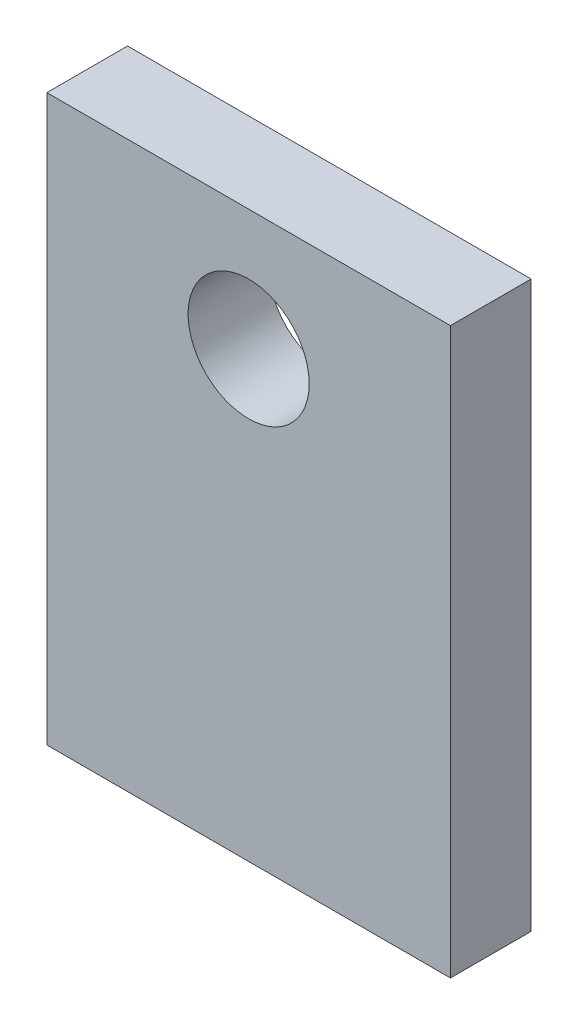
ISO-10303-21;
HEADER;
FILE_DESCRIPTION(('STEP AP214'),'2;1');
FILE_NAME('part.step','',(''),(''),'','','');
FILE_SCHEMA(('AUTOMOTIVE_DESIGN { 1 0 10303 214 1 1 1 1 }'));
ENDSEC;
DATA;
#1=APPLICATION_CONTEXT('core data for automotive mechanical design processes');
#2=APPLICATION_PROTOCOL_DEFINITION('international standard','automotive_design',2000,#1);
#3=PRODUCT_CONTEXT('',#1,'mechanical');
#4=PRODUCT('Part','Part','',(#3));
#5=PRODUCT_RELATED_PRODUCT_CATEGORY('part','',(#4));
#6=PRODUCT_DEFINITION_FORMATION('','',#4);
#7=PRODUCT_DEFINITION_CONTEXT('part definition',#1,'design');
#8=PRODUCT_DEFINITION('design','',#6,#7);
#9=PRODUCT_DEFINITION_SHAPE('','',#8);
#10=(LENGTH_UNIT() NAMED_UNIT(*) SI_UNIT(.MILLI.,.METRE.));
#11=(NAMED_UNIT(*) PLANE_ANGLE_UNIT() SI_UNIT($,.RADIAN.));
#12=(NAMED_UNIT(*) SI_UNIT($,.STERADIAN.) SOLID_ANGLE_UNIT());
#13=UNCERTAINTY_MEASURE_WITH_UNIT(LENGTH_MEASURE(1.E-05),#10,'distance_accuracy_value','');
#14=(GEOMETRIC_REPRESENTATION_CONTEXT(3) GLOBAL_UNCERTAINTY_ASSIGNED_CONTEXT((#13)) GLOBAL_UNIT_ASSIGNED_CONTEXT((#10,
#11,#12)) REPRESENTATION_CONTEXT('',''));
#15=CARTESIAN_POINT('',(0.,0.,0.));
#16=DIRECTION('',(0.,0.,1.));
#17=DIRECTION('',(1.,0.,0.));
#18=AXIS2_PLACEMENT_3D('',#15,#16,#17);
#19=CARTESIAN_POINT('',(0.,177.8,25.4));
#20=DIRECTION('',(0.,0.,-1.));
#21=DIRECTION('',(-1.,0.,0.));
#22=AXIS2_PLACEMENT_3D('',#19,#20,#21);
#23=PLANE('',#22);
#24=DIRECTION('',(0.,-1.,0.));
#25=VECTOR('',#24,1.);
#26=CARTESIAN_POINT('',(0.,0.,25.4));
#27=LINE('',#26,#25);
#28=CARTESIAN_POINT('',(0.,177.8,25.4));
#29=VERTEX_POINT('',#28);
#30=CARTESIAN_POINT('',(0.,0.,25.4));
#31=VERTEX_POINT('',#30);
#32=EDGE_CURVE('E108',#29,#31,#27,.T.);
#33=ORIENTED_EDGE('',*,*,#32,.T.);
#34=DIRECTION('',(1.,0.,0.));
#35=VECTOR('',#34,1.);
#36=CARTESIAN_POINT('',(0.,0.,25.4));
#37=LINE('',#36,#35);
#38=CARTESIAN_POINT('',(127.,0.,25.4));
#39=VERTEX_POINT('',#38);
#40=EDGE_CURVE('E93',#31,#39,#37,.T.);
#41=ORIENTED_EDGE('',*,*,#40,.T.);
#42=DIRECTION('',(0.,1.,0.));
#43=VECTOR('',#42,1.);
#44=CARTESIAN_POINT('',(127.,0.,25.4));
#45=LINE('',#44,#43);
#46=CARTESIAN_POINT('',(127.,177.8,25.4));
#47=VERTEX_POINT('',#46);
#48=EDGE_CURVE('E59',#39,#47,#45,.T.);
#49=ORIENTED_EDGE('',*,*,#48,.T.);
#50=DIRECTION('',(-1.,0.,0.));
#51=VECTOR('',#50,1.);
#52=CARTESIAN_POINT('',(0.,177.8,25.4));
#53=LINE('',#52,#51);
#54=EDGE_CURVE('E54',#47,#29,#53,.T.);
#55=ORIENTED_EDGE('',*,*,#54,.T.);
#56=EDGE_LOOP('',(#33,#41,#49,#55));
#57=FACE_BOUND('',#56,.T.);
#58=CARTESIAN_POINT('',(63.5,139.7,25.4));
#59=DIRECTION('',(0.,0.,1.));
#60=DIRECTION('',(1.,0.,0.));
#61=AXIS2_PLACEMENT_3D('',#58,#59,#60);
#62=CIRCLE('',#61,19.05);
#63=CARTESIAN_POINT('',(82.55,139.7,25.4));
#64=VERTEX_POINT('',#63);
#65=EDGE_CURVE('E98',#64,#64,#62,.T.);
#66=ORIENTED_EDGE('',*,*,#65,.F.);
#67=EDGE_LOOP('',(#66));
#68=FACE_BOUND('',#67,.T.);
#69=ADVANCED_FACE('F39',(#57,#68),#23,.F.);
#70=CARTESIAN_POINT('',(0.,177.8,0.));
#71=DIRECTION('',(0.,0.,-1.));
#72=DIRECTION('',(-1.,0.,0.));
#73=AXIS2_PLACEMENT_3D('',#70,#71,#72);
#74=PLANE('',#73);
#75=DIRECTION('',(0.,-1.,0.));
#76=VECTOR('',#75,1.);
#77=CARTESIAN_POINT('',(0.,0.,0.));
#78=LINE('',#77,#76);
#79=CARTESIAN_POINT('',(0.,177.8,0.));
#80=VERTEX_POINT('',#79);
#81=CARTESIAN_POINT('',(0.,0.,0.));
#82=VERTEX_POINT('',#81);
#83=EDGE_CURVE('E85',#80,#82,#78,.T.);
#84=ORIENTED_EDGE('',*,*,#83,.F.);
#85=DIRECTION('',(-1.,0.,0.));
#86=VECTOR('',#85,1.);
#87=CARTESIAN_POINT('',(0.,177.8,0.));
#88=LINE('',#87,#86);
#89=CARTESIAN_POINT('',(127.,177.8,0.));
#90=VERTEX_POINT('',#89);
#91=EDGE_CURVE('E106',#90,#80,#88,.T.);
#92=ORIENTED_EDGE('',*,*,#91,.F.);
#93=DIRECTION('',(0.,1.,0.));
#94=VECTOR('',#93,1.);
#95=CARTESIAN_POINT('',(127.,0.,0.));
#96=LINE('',#95,#94);
#97=CARTESIAN_POINT('',(127.,0.,0.));
#98=VERTEX_POINT('',#97);
#99=EDGE_CURVE('E86',#98,#90,#96,.T.);
#100=ORIENTED_EDGE('',*,*,#99,.F.);
#101=DIRECTION('',(1.,0.,0.));
#102=VECTOR('',#101,1.);
#103=CARTESIAN_POINT('',(0.,0.,0.));
#104=LINE('',#103,#102);
#105=EDGE_CURVE('E80',#82,#98,#104,.T.);
#106=ORIENTED_EDGE('',*,*,#105,.F.);
#107=EDGE_LOOP('',(#84,#92,#100,#106));
#108=FACE_BOUND('',#107,.T.);
#109=CARTESIAN_POINT('',(63.5,139.7,0.));
#110=DIRECTION('',(0.,0.,1.));
#111=DIRECTION('',(1.,0.,0.));
#112=AXIS2_PLACEMENT_3D('',#109,#110,#111);
#113=CIRCLE('',#112,19.05);
#114=CARTESIAN_POINT('',(82.55,139.7,0.));
#115=VERTEX_POINT('',#114);
#116=EDGE_CURVE('E101',#115,#115,#113,.T.);
#117=ORIENTED_EDGE('',*,*,#116,.T.);
#118=EDGE_LOOP('',(#117));
#119=FACE_BOUND('',#118,.T.);
#120=ADVANCED_FACE('F81',(#108,#119),#74,.T.);
#121=CARTESIAN_POINT('',(0.,0.,25.4));
#122=DIRECTION('',(1.,0.,0.));
#123=DIRECTION('',(0.,0.,-1.));
#124=AXIS2_PLACEMENT_3D('',#121,#122,#123);
#125=PLANE('',#124);
#126=ORIENTED_EDGE('',*,*,#83,.T.);
#127=DIRECTION('',(0.,0.,-1.));
#128=VECTOR('',#127,1.);
#129=CARTESIAN_POINT('',(0.,0.,25.4));
#130=LINE('',#129,#128);
#131=EDGE_CURVE('E11',#31,#82,#130,.T.);
#132=ORIENTED_EDGE('',*,*,#131,.F.);
#133=ORIENTED_EDGE('',*,*,#32,.F.);
#134=DIRECTION('',(0.,0.,-1.));
#135=VECTOR('',#134,1.);
#136=CARTESIAN_POINT('',(0.,177.8,25.4));
#137=LINE('',#136,#135);
#138=EDGE_CURVE('E97',#29,#80,#137,.T.);
#139=ORIENTED_EDGE('',*,*,#138,.T.);
#140=EDGE_LOOP('',(#126,#132,#133,#139));
#141=FACE_BOUND('',#140,.T.);
#142=ADVANCED_FACE('F41',(#141),#125,.F.);
#143=CARTESIAN_POINT('',(0.,0.,25.4));
#144=DIRECTION('',(0.,1.,0.));
#145=DIRECTION('',(0.,0.,1.));
#146=AXIS2_PLACEMENT_3D('',#143,#144,#145);
#147=PLANE('',#146);
#148=ORIENTED_EDGE('',*,*,#105,.T.);
#149=DIRECTION('',(0.,0.,-1.));
#150=VECTOR('',#149,1.);
#151=CARTESIAN_POINT('',(127.,0.,25.4));
#152=LINE('',#151,#150);
#153=EDGE_CURVE('E47',#39,#98,#152,.T.);
#154=ORIENTED_EDGE('',*,*,#153,.F.);
#155=ORIENTED_EDGE('',*,*,#40,.F.);
#156=ORIENTED_EDGE('',*,*,#131,.T.);
#157=EDGE_LOOP('',(#148,#154,#155,#156));
#158=FACE_BOUND('',#157,.T.);
#159=ADVANCED_FACE('F92',(#158),#147,.F.);
#160=CARTESIAN_POINT('',(127.,0.,25.4));
#161=DIRECTION('',(-1.,0.,0.));
#162=DIRECTION('',(0.,0.,1.));
#163=AXIS2_PLACEMENT_3D('',#160,#161,#162);
#164=PLANE('',#163);
#165=ORIENTED_EDGE('',*,*,#99,.T.);
#166=DIRECTION('',(0.,0.,-1.));
#167=VECTOR('',#166,1.);
#168=CARTESIAN_POINT('',(127.,177.8,25.4));
#169=LINE('',#168,#167);
#170=EDGE_CURVE('E114',#47,#90,#169,.T.);
#171=ORIENTED_EDGE('',*,*,#170,.F.);
#172=ORIENTED_EDGE('',*,*,#48,.F.);
#173=ORIENTED_EDGE('',*,*,#153,.T.);
#174=EDGE_LOOP('',(#165,#171,#172,#173));
#175=FACE_BOUND('',#174,.T.);
#176=ADVANCED_FACE('F117',(#175),#164,.F.);
#177=CARTESIAN_POINT('',(0.,177.8,25.4));
#178=DIRECTION('',(0.,-1.,0.));
#179=DIRECTION('',(0.,0.,-1.));
#180=AXIS2_PLACEMENT_3D('',#177,#178,#179);
#181=PLANE('',#180);
#182=ORIENTED_EDGE('',*,*,#91,.T.);
#183=ORIENTED_EDGE('',*,*,#138,.F.);
#184=ORIENTED_EDGE('',*,*,#54,.F.);
#185=ORIENTED_EDGE('',*,*,#170,.T.);
#186=EDGE_LOOP('',(#182,#183,#184,#185));
#187=FACE_BOUND('',#186,.T.);
#188=ADVANCED_FACE('F119',(#187),#181,.F.);
#189=CARTESIAN_POINT('',(63.5,139.7,25.4));
#190=DIRECTION('',(0.,0.,-1.));
#191=DIRECTION('',(-1.,0.,0.));
#192=AXIS2_PLACEMENT_3D('',#189,#190,#191);
#193=CYLINDRICAL_SURFACE('',#192,19.05);
#194=ORIENTED_EDGE('',*,*,#65,.T.);
#195=EDGE_LOOP('',(#194));
#196=FACE_BOUND('',#195,.T.);
#197=ORIENTED_EDGE('',*,*,#116,.F.);
#198=EDGE_LOOP('',(#197));
#199=FACE_BOUND('',#198,.T.);
#200=ADVANCED_FACE('F125',(#196,#199),#193,.F.);
#201=CLOSED_SHELL('',(#69,#120,#142,#159,#176,#188,#200));
#202=MANIFOLD_SOLID_BREP('B2',#201);
#203=ADVANCED_BREP_SHAPE_REPRESENTATION('',(#18,#202),#14);
#204=SHAPE_DEFINITION_REPRESENTATION(#9,#203);
ENDSEC;
END-ISO-10303-21;
